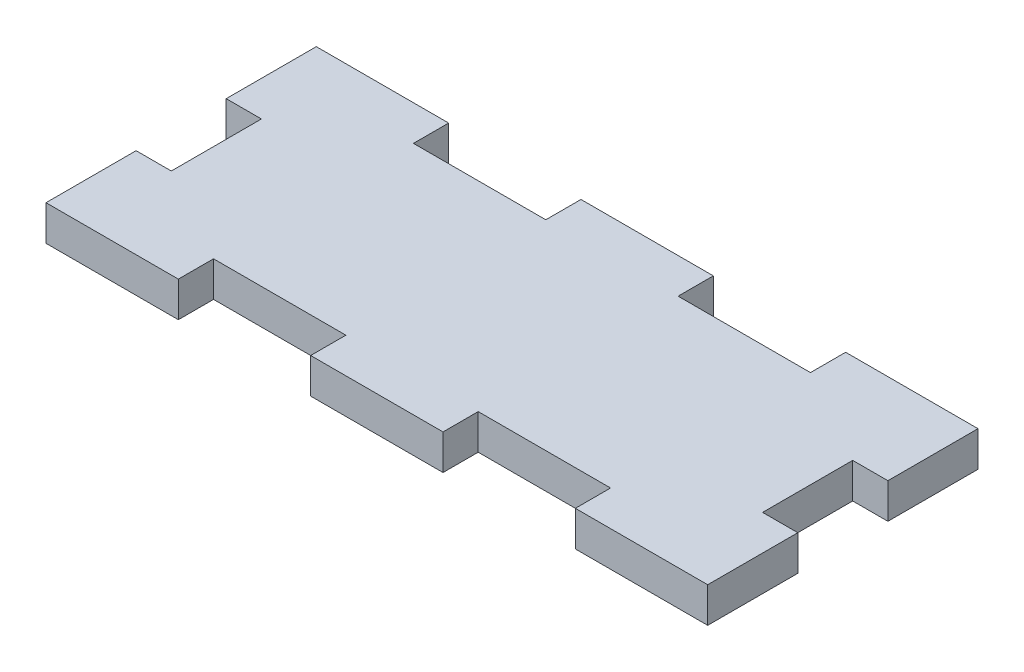
ISO-10303-21;
HEADER;
FILE_DESCRIPTION(('STEP AP214'),'2;1');
FILE_NAME('part.step','',(''),(''),'','','');
FILE_SCHEMA(('AUTOMOTIVE_DESIGN { 1 0 10303 214 1 1 1 1 }'));
ENDSEC;
DATA;
#1=APPLICATION_CONTEXT('core data for automotive mechanical design processes');
#2=APPLICATION_PROTOCOL_DEFINITION('international standard','automotive_design',2000,#1);
#3=PRODUCT_CONTEXT('',#1,'mechanical');
#4=PRODUCT('Part','Part','',(#3));
#5=PRODUCT_RELATED_PRODUCT_CATEGORY('part','',(#4));
#6=PRODUCT_DEFINITION_FORMATION('','',#4);
#7=PRODUCT_DEFINITION_CONTEXT('part definition',#1,'design');
#8=PRODUCT_DEFINITION('design','',#6,#7);
#9=PRODUCT_DEFINITION_SHAPE('','',#8);
#10=(LENGTH_UNIT() NAMED_UNIT(*) SI_UNIT(.MILLI.,.METRE.));
#11=(NAMED_UNIT(*) PLANE_ANGLE_UNIT() SI_UNIT($,.RADIAN.));
#12=(NAMED_UNIT(*) SI_UNIT($,.STERADIAN.) SOLID_ANGLE_UNIT());
#13=UNCERTAINTY_MEASURE_WITH_UNIT(LENGTH_MEASURE(1.E-05),#10,'distance_accuracy_value','');
#14=(GEOMETRIC_REPRESENTATION_CONTEXT(3) GLOBAL_UNCERTAINTY_ASSIGNED_CONTEXT((#13)) GLOBAL_UNIT_ASSIGNED_CONTEXT((#10,
#11,#12)) REPRESENTATION_CONTEXT('',''));
#15=CARTESIAN_POINT('',(0.,0.,0.));
#16=DIRECTION('',(0.,0.,1.));
#17=DIRECTION('',(1.,0.,0.));
#18=AXIS2_PLACEMENT_3D('',#15,#16,#17);
#19=CARTESIAN_POINT('',(29.845,3.175,12.192));
#20=DIRECTION('',(-1.,0.,0.));
#21=DIRECTION('',(0.,0.,1.));
#22=AXIS2_PLACEMENT_3D('',#19,#20,#21);
#23=PLANE('',#22);
#24=DIRECTION('',(0.,0.,-1.));
#25=VECTOR('',#24,1.);
#26=CARTESIAN_POINT('',(29.845,0.,12.192));
#27=LINE('',#26,#25);
#28=CARTESIAN_POINT('',(29.845,0.,12.192));
#29=VERTEX_POINT('',#28);
#30=CARTESIAN_POINT('',(29.845,0.,4.064));
#31=VERTEX_POINT('',#30);
#32=EDGE_CURVE('E396',#29,#31,#27,.T.);
#33=ORIENTED_EDGE('',*,*,#32,.T.);
#34=DIRECTION('',(0.,1.,0.));
#35=VECTOR('',#34,1.);
#36=CARTESIAN_POINT('',(29.845,3.175,4.064));
#37=LINE('',#36,#35);
#38=CARTESIAN_POINT('',(29.845,3.175,4.064));
#39=VERTEX_POINT('',#38);
#40=EDGE_CURVE('E264',#31,#39,#37,.T.);
#41=ORIENTED_EDGE('',*,*,#40,.T.);
#42=DIRECTION('',(0.,0.,-1.));
#43=VECTOR('',#42,1.);
#44=CARTESIAN_POINT('',(29.845,3.175,12.192));
#45=LINE('',#44,#43);
#46=CARTESIAN_POINT('',(29.845,3.175,12.192));
#47=VERTEX_POINT('',#46);
#48=EDGE_CURVE('E377',#47,#39,#45,.T.);
#49=ORIENTED_EDGE('',*,*,#48,.F.);
#50=DIRECTION('',(0.,-1.,0.));
#51=VECTOR('',#50,1.);
#52=CARTESIAN_POINT('',(29.845,3.175,12.192));
#53=LINE('',#52,#51);
#54=EDGE_CURVE('E394',#47,#29,#53,.T.);
#55=ORIENTED_EDGE('',*,*,#54,.T.);
#56=EDGE_LOOP('',(#33,#41,#49,#55));
#57=FACE_BOUND('',#56,.T.);
#58=ADVANCED_FACE('F33',(#57),#23,.F.);
#59=CARTESIAN_POINT('',(-29.845,3.175,12.192));
#60=DIRECTION('',(1.,0.,0.));
#61=DIRECTION('',(0.,0.,-1.));
#62=AXIS2_PLACEMENT_3D('',#59,#60,#61);
#63=PLANE('',#62);
#64=DIRECTION('',(0.,0.,1.));
#65=VECTOR('',#64,1.);
#66=CARTESIAN_POINT('',(-29.845,3.175,12.192));
#67=LINE('',#66,#65);
#68=CARTESIAN_POINT('',(-29.845,3.175,4.064));
#69=VERTEX_POINT('',#68);
#70=CARTESIAN_POINT('',(-29.845,3.175,12.192));
#71=VERTEX_POINT('',#70);
#72=EDGE_CURVE('E385',#69,#71,#67,.T.);
#73=ORIENTED_EDGE('',*,*,#72,.F.);
#74=DIRECTION('',(0.,-1.,0.));
#75=VECTOR('',#74,1.);
#76=CARTESIAN_POINT('',(-29.845,3.175,4.064));
#77=LINE('',#76,#75);
#78=CARTESIAN_POINT('',(-29.845,0.,4.064));
#79=VERTEX_POINT('',#78);
#80=EDGE_CURVE('E268',#69,#79,#77,.T.);
#81=ORIENTED_EDGE('',*,*,#80,.T.);
#82=DIRECTION('',(0.,0.,1.));
#83=VECTOR('',#82,1.);
#84=CARTESIAN_POINT('',(-29.845,0.,12.192));
#85=LINE('',#84,#83);
#86=CARTESIAN_POINT('',(-29.845,0.,12.192));
#87=VERTEX_POINT('',#86);
#88=EDGE_CURVE('E403',#79,#87,#85,.T.);
#89=ORIENTED_EDGE('',*,*,#88,.T.);
#90=DIRECTION('',(0.,-1.,0.));
#91=VECTOR('',#90,1.);
#92=CARTESIAN_POINT('',(-29.845,3.175,12.192));
#93=LINE('',#92,#91);
#94=EDGE_CURVE('E414',#71,#87,#93,.T.);
#95=ORIENTED_EDGE('',*,*,#94,.F.);
#96=EDGE_LOOP('',(#73,#81,#89,#95));
#97=FACE_BOUND('',#96,.T.);
#98=ADVANCED_FACE('F483',(#97),#63,.F.);
#99=CARTESIAN_POINT('',(-29.845,3.175,-12.192));
#100=DIRECTION('',(0.,0.,1.));
#101=DIRECTION('',(1.,0.,0.));
#102=AXIS2_PLACEMENT_3D('',#99,#100,#101);
#103=PLANE('',#102);
#104=DIRECTION('',(-1.,0.,0.));
#105=VECTOR('',#104,1.);
#106=CARTESIAN_POINT('',(-29.845,3.175,-12.192));
#107=LINE('',#106,#105);
#108=CARTESIAN_POINT('',(-17.907,3.175,-12.192));
#109=VERTEX_POINT('',#108);
#110=CARTESIAN_POINT('',(-29.845,3.175,-12.192));
#111=VERTEX_POINT('',#110);
#112=EDGE_CURVE('E380',#109,#111,#107,.T.);
#113=ORIENTED_EDGE('',*,*,#112,.F.);
#114=DIRECTION('',(0.,1.,0.));
#115=VECTOR('',#114,1.);
#116=CARTESIAN_POINT('',(-17.907,0.,-12.192));
#117=LINE('',#116,#115);
#118=CARTESIAN_POINT('',(-17.907,0.,-12.192));
#119=VERTEX_POINT('',#118);
#120=EDGE_CURVE('E291',#119,#109,#117,.T.);
#121=ORIENTED_EDGE('',*,*,#120,.F.);
#122=DIRECTION('',(-1.,0.,0.));
#123=VECTOR('',#122,1.);
#124=CARTESIAN_POINT('',(-29.845,0.,-12.192));
#125=LINE('',#124,#123);
#126=CARTESIAN_POINT('',(-29.845,0.,-12.192));
#127=VERTEX_POINT('',#126);
#128=EDGE_CURVE('E399',#119,#127,#125,.T.);
#129=ORIENTED_EDGE('',*,*,#128,.T.);
#130=DIRECTION('',(0.,-1.,0.));
#131=VECTOR('',#130,1.);
#132=CARTESIAN_POINT('',(-29.845,3.175,-12.192));
#133=LINE('',#132,#131);
#134=EDGE_CURVE('E417',#111,#127,#133,.T.);
#135=ORIENTED_EDGE('',*,*,#134,.F.);
#136=EDGE_LOOP('',(#113,#121,#129,#135));
#137=FACE_BOUND('',#136,.T.);
#138=ADVANCED_FACE('F487',(#137),#103,.F.);
#139=CARTESIAN_POINT('',(-29.845,3.175,12.192));
#140=DIRECTION('',(0.,0.,-1.));
#141=DIRECTION('',(-1.,0.,0.));
#142=AXIS2_PLACEMENT_3D('',#139,#140,#141);
#143=PLANE('',#142);
#144=DIRECTION('',(1.,0.,0.));
#145=VECTOR('',#144,1.);
#146=CARTESIAN_POINT('',(-29.845,0.,12.192));
#147=LINE('',#146,#145);
#148=CARTESIAN_POINT('',(-17.907,0.,12.192));
#149=VERTEX_POINT('',#148);
#150=EDGE_CURVE('E408',#87,#149,#147,.T.);
#151=ORIENTED_EDGE('',*,*,#150,.T.);
#152=DIRECTION('',(0.,1.,0.));
#153=VECTOR('',#152,1.);
#154=CARTESIAN_POINT('',(-17.907,0.,12.192));
#155=LINE('',#154,#153);
#156=CARTESIAN_POINT('',(-17.907,3.175,12.192));
#157=VERTEX_POINT('',#156);
#158=EDGE_CURVE('E310',#149,#157,#155,.T.);
#159=ORIENTED_EDGE('',*,*,#158,.T.);
#160=DIRECTION('',(1.,0.,0.));
#161=VECTOR('',#160,1.);
#162=CARTESIAN_POINT('',(-29.845,3.175,12.192));
#163=LINE('',#162,#161);
#164=EDGE_CURVE('E391',#71,#157,#163,.T.);
#165=ORIENTED_EDGE('',*,*,#164,.F.);
#166=ORIENTED_EDGE('',*,*,#94,.T.);
#167=EDGE_LOOP('',(#151,#159,#165,#166));
#168=FACE_BOUND('',#167,.T.);
#169=ADVANCED_FACE('F475',(#168),#143,.F.);
#170=CARTESIAN_POINT('',(5.969,0.,-12.192));
#171=VERTEX_POINT('',#170);
#172=CARTESIAN_POINT('',(-5.969,0.,-12.192));
#173=VERTEX_POINT('',#172);
#174=EDGE_CURVE('E404',#171,#173,#125,.T.);
#175=ORIENTED_EDGE('',*,*,#174,.T.);
#176=DIRECTION('',(0.,1.,0.));
#177=VECTOR('',#176,1.);
#178=CARTESIAN_POINT('',(-5.969,0.,-12.192));
#179=LINE('',#178,#177);
#180=CARTESIAN_POINT('',(-5.969,3.175,-12.192));
#181=VERTEX_POINT('',#180);
#182=EDGE_CURVE('E294',#173,#181,#179,.T.);
#183=ORIENTED_EDGE('',*,*,#182,.T.);
#184=CARTESIAN_POINT('',(5.969,3.175,-12.192));
#185=VERTEX_POINT('',#184);
#186=EDGE_CURVE('E386',#185,#181,#107,.T.);
#187=ORIENTED_EDGE('',*,*,#186,.F.);
#188=DIRECTION('',(0.,1.,0.));
#189=VECTOR('',#188,1.);
#190=CARTESIAN_POINT('',(5.969,0.,-12.192));
#191=LINE('',#190,#189);
#192=EDGE_CURVE('E343',#171,#185,#191,.T.);
#193=ORIENTED_EDGE('',*,*,#192,.F.);
#194=EDGE_LOOP('',(#175,#183,#187,#193));
#195=FACE_BOUND('',#194,.T.);
#196=ADVANCED_FACE('F486',(#195),#103,.F.);
#197=CARTESIAN_POINT('',(-5.969,3.175,12.192));
#198=VERTEX_POINT('',#197);
#199=CARTESIAN_POINT('',(5.96899999999999,3.175,12.192));
#200=VERTEX_POINT('',#199);
#201=EDGE_CURVE('E395',#198,#200,#163,.T.);
#202=ORIENTED_EDGE('',*,*,#201,.F.);
#203=DIRECTION('',(0.,1.,0.));
#204=VECTOR('',#203,1.);
#205=CARTESIAN_POINT('',(-5.969,0.,12.192));
#206=LINE('',#205,#204);
#207=CARTESIAN_POINT('',(-5.969,0.,12.192));
#208=VERTEX_POINT('',#207);
#209=EDGE_CURVE('E320',#208,#198,#206,.T.);
#210=ORIENTED_EDGE('',*,*,#209,.F.);
#211=CARTESIAN_POINT('',(5.96899999999999,0.,12.192));
#212=VERTEX_POINT('',#211);
#213=EDGE_CURVE('E411',#208,#212,#147,.T.);
#214=ORIENTED_EDGE('',*,*,#213,.T.);
#215=DIRECTION('',(0.,1.,0.));
#216=VECTOR('',#215,1.);
#217=CARTESIAN_POINT('',(5.96899999999999,0.,12.192));
#218=LINE('',#217,#216);
#219=EDGE_CURVE('E362',#212,#200,#218,.T.);
#220=ORIENTED_EDGE('',*,*,#219,.T.);
#221=EDGE_LOOP('',(#202,#210,#214,#220));
#222=FACE_BOUND('',#221,.T.);
#223=ADVANCED_FACE('F456',(#222),#143,.F.);
#224=CARTESIAN_POINT('',(29.845,3.175,-4.064));
#225=VERTEX_POINT('',#224);
#226=CARTESIAN_POINT('',(29.845,3.175,-12.192));
#227=VERTEX_POINT('',#226);
#228=EDGE_CURVE('E381',#225,#227,#45,.T.);
#229=ORIENTED_EDGE('',*,*,#228,.F.);
#230=DIRECTION('',(0.,-1.,0.));
#231=VECTOR('',#230,1.);
#232=CARTESIAN_POINT('',(29.845,3.175,-4.064));
#233=LINE('',#232,#231);
#234=CARTESIAN_POINT('',(29.845,0.,-4.064));
#235=VERTEX_POINT('',#234);
#236=EDGE_CURVE('E246',#225,#235,#233,.T.);
#237=ORIENTED_EDGE('',*,*,#236,.T.);
#238=CARTESIAN_POINT('',(29.845,0.,-12.192));
#239=VERTEX_POINT('',#238);
#240=EDGE_CURVE('E345',#235,#239,#27,.T.);
#241=ORIENTED_EDGE('',*,*,#240,.T.);
#242=DIRECTION('',(0.,-1.,0.));
#243=VECTOR('',#242,1.);
#244=CARTESIAN_POINT('',(29.845,3.175,-12.192));
#245=LINE('',#244,#243);
#246=EDGE_CURVE('E420',#227,#239,#245,.T.);
#247=ORIENTED_EDGE('',*,*,#246,.F.);
#248=EDGE_LOOP('',(#229,#237,#241,#247));
#249=FACE_BOUND('',#248,.T.);
#250=ADVANCED_FACE('F35',(#249),#23,.F.);
#251=CARTESIAN_POINT('',(17.907,0.,-12.192));
#252=VERTEX_POINT('',#251);
#253=EDGE_CURVE('E400',#239,#252,#125,.T.);
#254=ORIENTED_EDGE('',*,*,#253,.T.);
#255=DIRECTION('',(0.,1.,0.));
#256=VECTOR('',#255,1.);
#257=CARTESIAN_POINT('',(17.907,0.,-12.192));
#258=LINE('',#257,#256);
#259=CARTESIAN_POINT('',(17.907,3.175,-12.192));
#260=VERTEX_POINT('',#259);
#261=EDGE_CURVE('E346',#252,#260,#258,.T.);
#262=ORIENTED_EDGE('',*,*,#261,.T.);
#263=EDGE_CURVE('E382',#227,#260,#107,.T.);
#264=ORIENTED_EDGE('',*,*,#263,.F.);
#265=ORIENTED_EDGE('',*,*,#246,.T.);
#266=EDGE_LOOP('',(#254,#262,#264,#265));
#267=FACE_BOUND('',#266,.T.);
#268=ADVANCED_FACE('F433',(#267),#103,.F.);
#269=CARTESIAN_POINT('',(-29.845,0.,-4.06399999999999));
#270=VERTEX_POINT('',#269);
#271=EDGE_CURVE('E405',#127,#270,#85,.T.);
#272=ORIENTED_EDGE('',*,*,#271,.T.);
#273=DIRECTION('',(0.,1.,0.));
#274=VECTOR('',#273,1.);
#275=CARTESIAN_POINT('',(-29.845,3.175,-4.064));
#276=LINE('',#275,#274);
#277=CARTESIAN_POINT('',(-29.845,3.175,-4.064));
#278=VERTEX_POINT('',#277);
#279=EDGE_CURVE('E56',#270,#278,#276,.T.);
#280=ORIENTED_EDGE('',*,*,#279,.T.);
#281=EDGE_CURVE('E387',#111,#278,#67,.T.);
#282=ORIENTED_EDGE('',*,*,#281,.F.);
#283=ORIENTED_EDGE('',*,*,#134,.T.);
#284=EDGE_LOOP('',(#272,#280,#282,#283));
#285=FACE_BOUND('',#284,.T.);
#286=ADVANCED_FACE('F473',(#285),#63,.F.);
#287=CARTESIAN_POINT('',(17.907,3.175,12.192));
#288=VERTEX_POINT('',#287);
#289=EDGE_CURVE('E390',#288,#47,#163,.T.);
#290=ORIENTED_EDGE('',*,*,#289,.F.);
#291=DIRECTION('',(0.,1.,0.));
#292=VECTOR('',#291,1.);
#293=CARTESIAN_POINT('',(17.907,0.,12.192));
#294=LINE('',#293,#292);
#295=CARTESIAN_POINT('',(17.907,0.,12.192));
#296=VERTEX_POINT('',#295);
#297=EDGE_CURVE('E373',#296,#288,#294,.T.);
#298=ORIENTED_EDGE('',*,*,#297,.F.);
#299=EDGE_CURVE('E407',#296,#29,#147,.T.);
#300=ORIENTED_EDGE('',*,*,#299,.T.);
#301=ORIENTED_EDGE('',*,*,#54,.F.);
#302=EDGE_LOOP('',(#290,#298,#300,#301));
#303=FACE_BOUND('',#302,.T.);
#304=ADVANCED_FACE('F471',(#303),#143,.F.);
#305=CARTESIAN_POINT('',(0.,3.175,0.));
#306=DIRECTION('',(0.,-1.,0.));
#307=DIRECTION('',(0.,0.,-1.));
#308=AXIS2_PLACEMENT_3D('',#305,#306,#307);
#309=PLANE('',#308);
#310=DIRECTION('',(0.,0.,-1.));
#311=VECTOR('',#310,1.);
#312=CARTESIAN_POINT('',(-26.67,3.175,4.064));
#313=LINE('',#312,#311);
#314=CARTESIAN_POINT('',(-26.67,3.175,4.064));
#315=VERTEX_POINT('',#314);
#316=CARTESIAN_POINT('',(-26.67,3.175,-4.064));
#317=VERTEX_POINT('',#316);
#318=EDGE_CURVE('E226',#315,#317,#313,.T.);
#319=ORIENTED_EDGE('',*,*,#318,.F.);
#320=DIRECTION('',(1.,0.,0.));
#321=VECTOR('',#320,1.);
#322=CARTESIAN_POINT('',(-33.02,3.175,4.064));
#323=LINE('',#322,#321);
#324=EDGE_CURVE('E238',#69,#315,#323,.T.);
#325=ORIENTED_EDGE('',*,*,#324,.F.);
#326=ORIENTED_EDGE('',*,*,#72,.T.);
#327=ORIENTED_EDGE('',*,*,#164,.T.);
#328=DIRECTION('',(0.,0.,1.));
#329=VECTOR('',#328,1.);
#330=CARTESIAN_POINT('',(-17.907,3.175,12.192));
#331=LINE('',#330,#329);
#332=CARTESIAN_POINT('',(-17.907,3.175,9.017));
#333=VERTEX_POINT('',#332);
#334=EDGE_CURVE('E271',#333,#157,#331,.T.);
#335=ORIENTED_EDGE('',*,*,#334,.F.);
#336=DIRECTION('',(-1.,0.,0.));
#337=VECTOR('',#336,1.);
#338=CARTESIAN_POINT('',(-17.907,3.175,9.017));
#339=LINE('',#338,#337);
#340=CARTESIAN_POINT('',(-5.969,3.175,9.017));
#341=VERTEX_POINT('',#340);
#342=EDGE_CURVE('E304',#341,#333,#339,.T.);
#343=ORIENTED_EDGE('',*,*,#342,.F.);
#344=DIRECTION('',(0.,0.,-1.));
#345=VECTOR('',#344,1.);
#346=CARTESIAN_POINT('',(-5.969,3.175,12.192));
#347=LINE('',#346,#345);
#348=EDGE_CURVE('E312',#198,#341,#347,.T.);
#349=ORIENTED_EDGE('',*,*,#348,.F.);
#350=ORIENTED_EDGE('',*,*,#201,.T.);
#351=DIRECTION('',(0.,0.,1.));
#352=VECTOR('',#351,1.);
#353=CARTESIAN_POINT('',(5.96899999999999,3.175,12.192));
#354=LINE('',#353,#352);
#355=CARTESIAN_POINT('',(5.96899999999999,3.175,9.017));
#356=VERTEX_POINT('',#355);
#357=EDGE_CURVE('E293',#356,#200,#354,.T.);
#358=ORIENTED_EDGE('',*,*,#357,.F.);
#359=DIRECTION('',(-1.,0.,0.));
#360=VECTOR('',#359,1.);
#361=CARTESIAN_POINT('',(5.96899999999999,3.175,9.017));
#362=LINE('',#361,#360);
#363=CARTESIAN_POINT('',(17.907,3.175,9.017));
#364=VERTEX_POINT('',#363);
#365=EDGE_CURVE('E356',#364,#356,#362,.T.);
#366=ORIENTED_EDGE('',*,*,#365,.F.);
#367=DIRECTION('',(0.,0.,-1.));
#368=VECTOR('',#367,1.);
#369=CARTESIAN_POINT('',(17.907,3.175,12.192));
#370=LINE('',#369,#368);
#371=EDGE_CURVE('E365',#288,#364,#370,.T.);
#372=ORIENTED_EDGE('',*,*,#371,.F.);
#373=ORIENTED_EDGE('',*,*,#289,.T.);
#374=ORIENTED_EDGE('',*,*,#48,.T.);
#375=DIRECTION('',(1.,0.,0.));
#376=VECTOR('',#375,1.);
#377=CARTESIAN_POINT('',(26.67,3.175,4.064));
#378=LINE('',#377,#376);
#379=CARTESIAN_POINT('',(26.67,3.175,4.064));
#380=VERTEX_POINT('',#379);
#381=EDGE_CURVE('E250',#380,#39,#378,.T.);
#382=ORIENTED_EDGE('',*,*,#381,.F.);
#383=DIRECTION('',(0.,0.,1.));
#384=VECTOR('',#383,1.);
#385=CARTESIAN_POINT('',(26.67,3.175,4.064));
#386=LINE('',#385,#384);
#387=CARTESIAN_POINT('',(26.67,3.175,-4.064));
#388=VERTEX_POINT('',#387);
#389=EDGE_CURVE('E256',#388,#380,#386,.T.);
#390=ORIENTED_EDGE('',*,*,#389,.F.);
#391=DIRECTION('',(-1.,0.,0.));
#392=VECTOR('',#391,1.);
#393=CARTESIAN_POINT('',(26.67,3.175,-4.064));
#394=LINE('',#393,#392);
#395=EDGE_CURVE('E254',#225,#388,#394,.T.);
#396=ORIENTED_EDGE('',*,*,#395,.F.);
#397=ORIENTED_EDGE('',*,*,#228,.T.);
#398=ORIENTED_EDGE('',*,*,#263,.T.);
#399=DIRECTION('',(0.,0.,-1.));
#400=VECTOR('',#399,1.);
#401=CARTESIAN_POINT('',(17.907,3.175,-9.01700000000001));
#402=LINE('',#401,#400);
#403=CARTESIAN_POINT('',(17.907,3.175,-9.01700000000001));
#404=VERTEX_POINT('',#403);
#405=EDGE_CURVE('E328',#404,#260,#402,.T.);
#406=ORIENTED_EDGE('',*,*,#405,.F.);
#407=DIRECTION('',(1.,0.,0.));
#408=VECTOR('',#407,1.);
#409=CARTESIAN_POINT('',(5.969,3.175,-9.01700000000001));
#410=LINE('',#409,#408);
#411=CARTESIAN_POINT('',(5.969,3.175,-9.01700000000001));
#412=VERTEX_POINT('',#411);
#413=EDGE_CURVE('E338',#412,#404,#410,.T.);
#414=ORIENTED_EDGE('',*,*,#413,.F.);
#415=DIRECTION('',(0.,0.,1.));
#416=VECTOR('',#415,1.);
#417=CARTESIAN_POINT('',(5.969,3.175,-9.01700000000001));
#418=LINE('',#417,#416);
#419=EDGE_CURVE('E335',#185,#412,#418,.T.);
#420=ORIENTED_EDGE('',*,*,#419,.F.);
#421=ORIENTED_EDGE('',*,*,#186,.T.);
#422=DIRECTION('',(0.,0.,-1.));
#423=VECTOR('',#422,1.);
#424=CARTESIAN_POINT('',(-5.969,3.175,-9.01700000000001));
#425=LINE('',#424,#423);
#426=CARTESIAN_POINT('',(-5.969,3.175,-9.01700000000001));
#427=VERTEX_POINT('',#426);
#428=EDGE_CURVE('E276',#427,#181,#425,.T.);
#429=ORIENTED_EDGE('',*,*,#428,.F.);
#430=DIRECTION('',(1.,0.,0.));
#431=VECTOR('',#430,1.);
#432=CARTESIAN_POINT('',(-17.907,3.175,-9.01700000000001));
#433=LINE('',#432,#431);
#434=CARTESIAN_POINT('',(-17.907,3.175,-9.01700000000001));
#435=VERTEX_POINT('',#434);
#436=EDGE_CURVE('E286',#435,#427,#433,.T.);
#437=ORIENTED_EDGE('',*,*,#436,.F.);
#438=DIRECTION('',(0.,0.,1.));
#439=VECTOR('',#438,1.);
#440=CARTESIAN_POINT('',(-17.907,3.175,-9.01700000000001));
#441=LINE('',#440,#439);
#442=EDGE_CURVE('E283',#109,#435,#441,.T.);
#443=ORIENTED_EDGE('',*,*,#442,.F.);
#444=ORIENTED_EDGE('',*,*,#112,.T.);
#445=ORIENTED_EDGE('',*,*,#281,.T.);
#446=DIRECTION('',(-1.,0.,0.));
#447=VECTOR('',#446,1.);
#448=CARTESIAN_POINT('',(-33.02,3.175,-4.064));
#449=LINE('',#448,#447);
#450=EDGE_CURVE('E240',#317,#278,#449,.T.);
#451=ORIENTED_EDGE('',*,*,#450,.F.);
#452=EDGE_LOOP('',(#319,#325,#326,#327,#335,#343,#349,#350,#358,#366,#372,#373,#374,#382,#390,
#396,#397,#398,#406,#414,#420,#421,#429,#437,#443,#444,#445,#451));
#453=FACE_BOUND('',#452,.T.);
#454=ADVANCED_FACE('F436',(#453),#309,.F.);
#455=CARTESIAN_POINT('',(0.,0.,0.));
#456=DIRECTION('',(0.,-1.,0.));
#457=DIRECTION('',(0.,0.,-1.));
#458=AXIS2_PLACEMENT_3D('',#455,#456,#457);
#459=PLANE('',#458);
#460=DIRECTION('',(-1.,0.,0.));
#461=VECTOR('',#460,1.);
#462=CARTESIAN_POINT('',(0.,0.,4.064));
#463=LINE('',#462,#461);
#464=CARTESIAN_POINT('',(-26.67,0.,4.064));
#465=VERTEX_POINT('',#464);
#466=EDGE_CURVE('E11',#465,#79,#463,.T.);
#467=ORIENTED_EDGE('',*,*,#466,.F.);
#468=DIRECTION('',(0.,0.,-1.));
#469=VECTOR('',#468,1.);
#470=CARTESIAN_POINT('',(-26.67,0.,4.064));
#471=LINE('',#470,#469);
#472=CARTESIAN_POINT('',(-26.67,0.,-4.064));
#473=VERTEX_POINT('',#472);
#474=EDGE_CURVE('E223',#465,#473,#471,.T.);
#475=ORIENTED_EDGE('',*,*,#474,.T.);
#476=DIRECTION('',(-1.,0.,0.));
#477=VECTOR('',#476,1.);
#478=CARTESIAN_POINT('',(-33.02,0.,-4.064));
#479=LINE('',#478,#477);
#480=EDGE_CURVE('E229',#473,#270,#479,.T.);
#481=ORIENTED_EDGE('',*,*,#480,.T.);
#482=ORIENTED_EDGE('',*,*,#271,.F.);
#483=ORIENTED_EDGE('',*,*,#128,.F.);
#484=DIRECTION('',(0.,0.,1.));
#485=VECTOR('',#484,1.);
#486=CARTESIAN_POINT('',(-17.907,0.,-9.01700000000001));
#487=LINE('',#486,#485);
#488=CARTESIAN_POINT('',(-17.907,0.,-9.01700000000001));
#489=VERTEX_POINT('',#488);
#490=EDGE_CURVE('E272',#119,#489,#487,.T.);
#491=ORIENTED_EDGE('',*,*,#490,.T.);
#492=DIRECTION('',(1.,0.,0.));
#493=VECTOR('',#492,1.);
#494=CARTESIAN_POINT('',(-17.907,0.,-9.01700000000001));
#495=LINE('',#494,#493);
#496=CARTESIAN_POINT('',(-5.969,0.,-9.01700000000001));
#497=VERTEX_POINT('',#496);
#498=EDGE_CURVE('E275',#489,#497,#495,.T.);
#499=ORIENTED_EDGE('',*,*,#498,.T.);
#500=DIRECTION('',(0.,0.,-1.));
#501=VECTOR('',#500,1.);
#502=CARTESIAN_POINT('',(-5.969,0.,-9.01700000000001));
#503=LINE('',#502,#501);
#504=EDGE_CURVE('E279',#497,#173,#503,.T.);
#505=ORIENTED_EDGE('',*,*,#504,.T.);
#506=ORIENTED_EDGE('',*,*,#174,.F.);
#507=DIRECTION('',(0.,0.,1.));
#508=VECTOR('',#507,1.);
#509=CARTESIAN_POINT('',(5.969,0.,-9.01700000000001));
#510=LINE('',#509,#508);
#511=CARTESIAN_POINT('',(5.969,0.,-9.01700000000001));
#512=VERTEX_POINT('',#511);
#513=EDGE_CURVE('E324',#171,#512,#510,.T.);
#514=ORIENTED_EDGE('',*,*,#513,.T.);
#515=DIRECTION('',(1.,0.,0.));
#516=VECTOR('',#515,1.);
#517=CARTESIAN_POINT('',(5.969,0.,-9.01700000000001));
#518=LINE('',#517,#516);
#519=CARTESIAN_POINT('',(17.907,0.,-9.01700000000001));
#520=VERTEX_POINT('',#519);
#521=EDGE_CURVE('E327',#512,#520,#518,.T.);
#522=ORIENTED_EDGE('',*,*,#521,.T.);
#523=DIRECTION('',(0.,0.,-1.));
#524=VECTOR('',#523,1.);
#525=CARTESIAN_POINT('',(17.907,0.,-9.01700000000001));
#526=LINE('',#525,#524);
#527=EDGE_CURVE('E331',#520,#252,#526,.T.);
#528=ORIENTED_EDGE('',*,*,#527,.T.);
#529=ORIENTED_EDGE('',*,*,#253,.F.);
#530=ORIENTED_EDGE('',*,*,#240,.F.);
#531=DIRECTION('',(1.,0.,0.));
#532=VECTOR('',#531,1.);
#533=CARTESIAN_POINT('',(0.,0.,-4.064));
#534=LINE('',#533,#532);
#535=CARTESIAN_POINT('',(26.67,0.,-4.064));
#536=VERTEX_POINT('',#535);
#537=EDGE_CURVE('E41',#536,#235,#534,.T.);
#538=ORIENTED_EDGE('',*,*,#537,.F.);
#539=DIRECTION('',(0.,0.,1.));
#540=VECTOR('',#539,1.);
#541=CARTESIAN_POINT('',(26.67,0.,4.064));
#542=LINE('',#541,#540);
#543=CARTESIAN_POINT('',(26.67,0.,4.064));
#544=VERTEX_POINT('',#543);
#545=EDGE_CURVE('E48',#536,#544,#542,.T.);
#546=ORIENTED_EDGE('',*,*,#545,.T.);
#547=DIRECTION('',(1.,0.,0.));
#548=VECTOR('',#547,1.);
#549=CARTESIAN_POINT('',(26.67,0.,4.064));
#550=LINE('',#549,#548);
#551=EDGE_CURVE('E249',#544,#31,#550,.T.);
#552=ORIENTED_EDGE('',*,*,#551,.T.);
#553=ORIENTED_EDGE('',*,*,#32,.F.);
#554=ORIENTED_EDGE('',*,*,#299,.F.);
#555=DIRECTION('',(0.,0.,-1.));
#556=VECTOR('',#555,1.);
#557=CARTESIAN_POINT('',(17.907,0.,12.192));
#558=LINE('',#557,#556);
#559=CARTESIAN_POINT('',(17.907,0.,9.017));
#560=VERTEX_POINT('',#559);
#561=EDGE_CURVE('E355',#296,#560,#558,.T.);
#562=ORIENTED_EDGE('',*,*,#561,.T.);
#563=DIRECTION('',(-1.,0.,0.));
#564=VECTOR('',#563,1.);
#565=CARTESIAN_POINT('',(5.96899999999999,0.,9.017));
#566=LINE('',#565,#564);
#567=CARTESIAN_POINT('',(5.96899999999999,0.,9.017));
#568=VERTEX_POINT('',#567);
#569=EDGE_CURVE('E359',#560,#568,#566,.T.);
#570=ORIENTED_EDGE('',*,*,#569,.T.);
#571=DIRECTION('',(0.,0.,1.));
#572=VECTOR('',#571,1.);
#573=CARTESIAN_POINT('',(5.96899999999999,0.,12.192));
#574=LINE('',#573,#572);
#575=EDGE_CURVE('E352',#568,#212,#574,.T.);
#576=ORIENTED_EDGE('',*,*,#575,.T.);
#577=ORIENTED_EDGE('',*,*,#213,.F.);
#578=DIRECTION('',(0.,0.,-1.));
#579=VECTOR('',#578,1.);
#580=CARTESIAN_POINT('',(-5.969,0.,12.192));
#581=LINE('',#580,#579);
#582=CARTESIAN_POINT('',(-5.969,0.,9.017));
#583=VERTEX_POINT('',#582);
#584=EDGE_CURVE('E303',#208,#583,#581,.T.);
#585=ORIENTED_EDGE('',*,*,#584,.T.);
#586=DIRECTION('',(-1.,0.,0.));
#587=VECTOR('',#586,1.);
#588=CARTESIAN_POINT('',(-17.907,0.,9.017));
#589=LINE('',#588,#587);
#590=CARTESIAN_POINT('',(-17.907,0.,9.017));
#591=VERTEX_POINT('',#590);
#592=EDGE_CURVE('E307',#583,#591,#589,.T.);
#593=ORIENTED_EDGE('',*,*,#592,.T.);
#594=DIRECTION('',(0.,0.,1.));
#595=VECTOR('',#594,1.);
#596=CARTESIAN_POINT('',(-17.907,0.,12.192));
#597=LINE('',#596,#595);
#598=EDGE_CURVE('E300',#591,#149,#597,.T.);
#599=ORIENTED_EDGE('',*,*,#598,.T.);
#600=ORIENTED_EDGE('',*,*,#150,.F.);
#601=ORIENTED_EDGE('',*,*,#88,.F.);
#602=EDGE_LOOP('',(#467,#475,#481,#482,#483,#491,#499,#505,#506,#514,#522,#528,#529,#530,#538,
#546,#552,#553,#554,#562,#570,#576,#577,#585,#593,#599,#600,#601));
#603=FACE_BOUND('',#602,.T.);
#604=ADVANCED_FACE('F236',(#603),#459,.T.);
#605=CARTESIAN_POINT('',(5.96899999999999,0.,12.192));
#606=DIRECTION('',(-1.,0.,0.));
#607=DIRECTION('',(0.,0.,1.));
#608=AXIS2_PLACEMENT_3D('',#605,#606,#607);
#609=PLANE('',#608);
#610=ORIENTED_EDGE('',*,*,#357,.T.);
#611=ORIENTED_EDGE('',*,*,#219,.F.);
#612=ORIENTED_EDGE('',*,*,#575,.F.);
#613=DIRECTION('',(0.,1.,0.));
#614=VECTOR('',#613,1.);
#615=CARTESIAN_POINT('',(5.96899999999999,0.,9.017));
#616=LINE('',#615,#614);
#617=EDGE_CURVE('E339',#568,#356,#616,.T.);
#618=ORIENTED_EDGE('',*,*,#617,.T.);
#619=EDGE_LOOP('',(#610,#611,#612,#618));
#620=FACE_BOUND('',#619,.T.);
#621=ADVANCED_FACE('F459',(#620),#609,.F.);
#622=CARTESIAN_POINT('',(5.96899999999999,0.,9.017));
#623=DIRECTION('',(0.,0.,-1.));
#624=DIRECTION('',(-1.,0.,0.));
#625=AXIS2_PLACEMENT_3D('',#622,#623,#624);
#626=PLANE('',#625);
#627=ORIENTED_EDGE('',*,*,#365,.T.);
#628=ORIENTED_EDGE('',*,*,#617,.F.);
#629=ORIENTED_EDGE('',*,*,#569,.F.);
#630=DIRECTION('',(0.,1.,0.));
#631=VECTOR('',#630,1.);
#632=CARTESIAN_POINT('',(17.907,0.,9.017));
#633=LINE('',#632,#631);
#634=EDGE_CURVE('E371',#560,#364,#633,.T.);
#635=ORIENTED_EDGE('',*,*,#634,.T.);
#636=EDGE_LOOP('',(#627,#628,#629,#635));
#637=FACE_BOUND('',#636,.T.);
#638=ADVANCED_FACE('F463',(#637),#626,.F.);
#639=CARTESIAN_POINT('',(17.907,0.,12.192));
#640=DIRECTION('',(1.,0.,0.));
#641=DIRECTION('',(0.,0.,-1.));
#642=AXIS2_PLACEMENT_3D('',#639,#640,#641);
#643=PLANE('',#642);
#644=ORIENTED_EDGE('',*,*,#371,.T.);
#645=ORIENTED_EDGE('',*,*,#634,.F.);
#646=ORIENTED_EDGE('',*,*,#561,.F.);
#647=ORIENTED_EDGE('',*,*,#297,.T.);
#648=EDGE_LOOP('',(#644,#645,#646,#647));
#649=FACE_BOUND('',#648,.T.);
#650=ADVANCED_FACE('F465',(#649),#643,.F.);
#651=CARTESIAN_POINT('',(5.969,0.,-9.01700000000001));
#652=DIRECTION('',(-1.,0.,0.));
#653=DIRECTION('',(0.,0.,1.));
#654=AXIS2_PLACEMENT_3D('',#651,#652,#653);
#655=PLANE('',#654);
#656=ORIENTED_EDGE('',*,*,#419,.T.);
#657=DIRECTION('',(0.,1.,0.));
#658=VECTOR('',#657,1.);
#659=CARTESIAN_POINT('',(5.969,0.,-9.01700000000001));
#660=LINE('',#659,#658);
#661=EDGE_CURVE('E334',#512,#412,#660,.T.);
#662=ORIENTED_EDGE('',*,*,#661,.F.);
#663=ORIENTED_EDGE('',*,*,#513,.F.);
#664=ORIENTED_EDGE('',*,*,#192,.T.);
#665=EDGE_LOOP('',(#656,#662,#663,#664));
#666=FACE_BOUND('',#665,.T.);
#667=ADVANCED_FACE('F522',(#666),#655,.F.);
#668=CARTESIAN_POINT('',(17.907,0.,-9.01700000000001));
#669=DIRECTION('',(1.,0.,0.));
#670=DIRECTION('',(0.,0.,-1.));
#671=AXIS2_PLACEMENT_3D('',#668,#669,#670);
#672=PLANE('',#671);
#673=ORIENTED_EDGE('',*,*,#405,.T.);
#674=ORIENTED_EDGE('',*,*,#261,.F.);
#675=ORIENTED_EDGE('',*,*,#527,.F.);
#676=DIRECTION('',(0.,1.,0.));
#677=VECTOR('',#676,1.);
#678=CARTESIAN_POINT('',(17.907,0.,-9.01700000000001));
#679=LINE('',#678,#677);
#680=EDGE_CURVE('E349',#520,#404,#679,.T.);
#681=ORIENTED_EDGE('',*,*,#680,.T.);
#682=EDGE_LOOP('',(#673,#674,#675,#681));
#683=FACE_BOUND('',#682,.T.);
#684=ADVANCED_FACE('F528',(#683),#672,.F.);
#685=CARTESIAN_POINT('',(5.969,0.,-9.01700000000001));
#686=DIRECTION('',(0.,0.,1.));
#687=DIRECTION('',(1.,0.,0.));
#688=AXIS2_PLACEMENT_3D('',#685,#686,#687);
#689=PLANE('',#688);
#690=ORIENTED_EDGE('',*,*,#413,.T.);
#691=ORIENTED_EDGE('',*,*,#680,.F.);
#692=ORIENTED_EDGE('',*,*,#521,.F.);
#693=ORIENTED_EDGE('',*,*,#661,.T.);
#694=EDGE_LOOP('',(#690,#691,#692,#693));
#695=FACE_BOUND('',#694,.T.);
#696=ADVANCED_FACE('F526',(#695),#689,.F.);
#697=CARTESIAN_POINT('',(-17.907,0.,12.192));
#698=DIRECTION('',(-1.,0.,0.));
#699=DIRECTION('',(0.,0.,1.));
#700=AXIS2_PLACEMENT_3D('',#697,#698,#699);
#701=PLANE('',#700);
#702=ORIENTED_EDGE('',*,*,#334,.T.);
#703=ORIENTED_EDGE('',*,*,#158,.F.);
#704=ORIENTED_EDGE('',*,*,#598,.F.);
#705=DIRECTION('',(0.,1.,0.));
#706=VECTOR('',#705,1.);
#707=CARTESIAN_POINT('',(-17.907,0.,9.017));
#708=LINE('',#707,#706);
#709=EDGE_CURVE('E287',#591,#333,#708,.T.);
#710=ORIENTED_EDGE('',*,*,#709,.T.);
#711=EDGE_LOOP('',(#702,#703,#704,#710));
#712=FACE_BOUND('',#711,.T.);
#713=ADVANCED_FACE('F535',(#712),#701,.F.);
#714=CARTESIAN_POINT('',(-17.907,0.,9.017));
#715=DIRECTION('',(0.,0.,-1.));
#716=DIRECTION('',(-1.,0.,0.));
#717=AXIS2_PLACEMENT_3D('',#714,#715,#716);
#718=PLANE('',#717);
#719=ORIENTED_EDGE('',*,*,#342,.T.);
#720=ORIENTED_EDGE('',*,*,#709,.F.);
#721=ORIENTED_EDGE('',*,*,#592,.F.);
#722=DIRECTION('',(0.,1.,0.));
#723=VECTOR('',#722,1.);
#724=CARTESIAN_POINT('',(-5.969,0.,9.017));
#725=LINE('',#724,#723);
#726=EDGE_CURVE('E318',#583,#341,#725,.T.);
#727=ORIENTED_EDGE('',*,*,#726,.T.);
#728=EDGE_LOOP('',(#719,#720,#721,#727));
#729=FACE_BOUND('',#728,.T.);
#730=ADVANCED_FACE('F609',(#729),#718,.F.);
#731=CARTESIAN_POINT('',(-5.969,0.,12.192));
#732=DIRECTION('',(1.,0.,0.));
#733=DIRECTION('',(0.,0.,-1.));
#734=AXIS2_PLACEMENT_3D('',#731,#732,#733);
#735=PLANE('',#734);
#736=ORIENTED_EDGE('',*,*,#348,.T.);
#737=ORIENTED_EDGE('',*,*,#726,.F.);
#738=ORIENTED_EDGE('',*,*,#584,.F.);
#739=ORIENTED_EDGE('',*,*,#209,.T.);
#740=EDGE_LOOP('',(#736,#737,#738,#739));
#741=FACE_BOUND('',#740,.T.);
#742=ADVANCED_FACE('F618',(#741),#735,.F.);
#743=CARTESIAN_POINT('',(-17.907,0.,-9.01700000000001));
#744=DIRECTION('',(-1.,0.,0.));
#745=DIRECTION('',(0.,0.,1.));
#746=AXIS2_PLACEMENT_3D('',#743,#744,#745);
#747=PLANE('',#746);
#748=ORIENTED_EDGE('',*,*,#442,.T.);
#749=DIRECTION('',(0.,1.,0.));
#750=VECTOR('',#749,1.);
#751=CARTESIAN_POINT('',(-17.907,0.,-9.01700000000001));
#752=LINE('',#751,#750);
#753=EDGE_CURVE('E282',#489,#435,#752,.T.);
#754=ORIENTED_EDGE('',*,*,#753,.F.);
#755=ORIENTED_EDGE('',*,*,#490,.F.);
#756=ORIENTED_EDGE('',*,*,#120,.T.);
#757=EDGE_LOOP('',(#748,#754,#755,#756));
#758=FACE_BOUND('',#757,.T.);
#759=ADVANCED_FACE('F628',(#758),#747,.F.);
#760=CARTESIAN_POINT('',(-5.969,0.,-9.01700000000001));
#761=DIRECTION('',(1.,0.,0.));
#762=DIRECTION('',(0.,0.,-1.));
#763=AXIS2_PLACEMENT_3D('',#760,#761,#762);
#764=PLANE('',#763);
#765=ORIENTED_EDGE('',*,*,#428,.T.);
#766=ORIENTED_EDGE('',*,*,#182,.F.);
#767=ORIENTED_EDGE('',*,*,#504,.F.);
#768=DIRECTION('',(0.,1.,0.));
#769=VECTOR('',#768,1.);
#770=CARTESIAN_POINT('',(-5.969,0.,-9.01700000000001));
#771=LINE('',#770,#769);
#772=EDGE_CURVE('E297',#497,#427,#771,.T.);
#773=ORIENTED_EDGE('',*,*,#772,.T.);
#774=EDGE_LOOP('',(#765,#766,#767,#773));
#775=FACE_BOUND('',#774,.T.);
#776=ADVANCED_FACE('F637',(#775),#764,.F.);
#777=CARTESIAN_POINT('',(-17.907,0.,-9.01700000000001));
#778=DIRECTION('',(0.,0.,1.));
#779=DIRECTION('',(1.,0.,0.));
#780=AXIS2_PLACEMENT_3D('',#777,#778,#779);
#781=PLANE('',#780);
#782=ORIENTED_EDGE('',*,*,#436,.T.);
#783=ORIENTED_EDGE('',*,*,#772,.F.);
#784=ORIENTED_EDGE('',*,*,#498,.F.);
#785=ORIENTED_EDGE('',*,*,#753,.T.);
#786=EDGE_LOOP('',(#782,#783,#784,#785));
#787=FACE_BOUND('',#786,.T.);
#788=ADVANCED_FACE('F647',(#787),#781,.F.);
#789=CARTESIAN_POINT('',(26.67,0.,4.064));
#790=DIRECTION('',(0.,0.,1.));
#791=DIRECTION('',(1.,0.,0.));
#792=AXIS2_PLACEMENT_3D('',#789,#790,#791);
#793=PLANE('',#792);
#794=ORIENTED_EDGE('',*,*,#551,.F.);
#795=DIRECTION('',(0.,1.,0.));
#796=VECTOR('',#795,1.);
#797=CARTESIAN_POINT('',(26.67,0.,4.064));
#798=LINE('',#797,#796);
#799=EDGE_CURVE('E244',#544,#380,#798,.T.);
#800=ORIENTED_EDGE('',*,*,#799,.T.);
#801=ORIENTED_EDGE('',*,*,#381,.T.);
#802=ORIENTED_EDGE('',*,*,#40,.F.);
#803=EDGE_LOOP('',(#794,#800,#801,#802));
#804=FACE_BOUND('',#803,.T.);
#805=ADVANCED_FACE('F444',(#804),#793,.F.);
#806=CARTESIAN_POINT('',(26.67,0.,-4.064));
#807=DIRECTION('',(0.,0.,-1.));
#808=DIRECTION('',(-1.,0.,0.));
#809=AXIS2_PLACEMENT_3D('',#806,#807,#808);
#810=PLANE('',#809);
#811=ORIENTED_EDGE('',*,*,#395,.T.);
#812=DIRECTION('',(0.,1.,0.));
#813=VECTOR('',#812,1.);
#814=CARTESIAN_POINT('',(26.67,0.,-4.064));
#815=LINE('',#814,#813);
#816=EDGE_CURVE('E253',#536,#388,#815,.T.);
#817=ORIENTED_EDGE('',*,*,#816,.F.);
#818=ORIENTED_EDGE('',*,*,#537,.T.);
#819=ORIENTED_EDGE('',*,*,#236,.F.);
#820=EDGE_LOOP('',(#811,#817,#818,#819));
#821=FACE_BOUND('',#820,.T.);
#822=ADVANCED_FACE('F424',(#821),#810,.F.);
#823=CARTESIAN_POINT('',(26.67,0.,4.064));
#824=DIRECTION('',(-1.,0.,0.));
#825=DIRECTION('',(0.,0.,1.));
#826=AXIS2_PLACEMENT_3D('',#823,#824,#825);
#827=PLANE('',#826);
#828=ORIENTED_EDGE('',*,*,#389,.T.);
#829=ORIENTED_EDGE('',*,*,#799,.F.);
#830=ORIENTED_EDGE('',*,*,#545,.F.);
#831=ORIENTED_EDGE('',*,*,#816,.T.);
#832=EDGE_LOOP('',(#828,#829,#830,#831));
#833=FACE_BOUND('',#832,.T.);
#834=ADVANCED_FACE('F440',(#833),#827,.F.);
#835=CARTESIAN_POINT('',(-33.02,0.,4.064));
#836=DIRECTION('',(0.,0.,1.));
#837=DIRECTION('',(1.,0.,0.));
#838=AXIS2_PLACEMENT_3D('',#835,#836,#837);
#839=PLANE('',#838);
#840=ORIENTED_EDGE('',*,*,#324,.T.);
#841=DIRECTION('',(0.,1.,0.));
#842=VECTOR('',#841,1.);
#843=CARTESIAN_POINT('',(-26.67,0.,4.064));
#844=LINE('',#843,#842);
#845=EDGE_CURVE('E228',#465,#315,#844,.T.);
#846=ORIENTED_EDGE('',*,*,#845,.F.);
#847=ORIENTED_EDGE('',*,*,#466,.T.);
#848=ORIENTED_EDGE('',*,*,#80,.F.);
#849=EDGE_LOOP('',(#840,#846,#847,#848));
#850=FACE_BOUND('',#849,.T.);
#851=ADVANCED_FACE('F714',(#850),#839,.F.);
#852=CARTESIAN_POINT('',(-33.02,0.,-4.064));
#853=DIRECTION('',(0.,0.,-1.));
#854=DIRECTION('',(-1.,0.,0.));
#855=AXIS2_PLACEMENT_3D('',#852,#853,#854);
#856=PLANE('',#855);
#857=ORIENTED_EDGE('',*,*,#480,.F.);
#858=DIRECTION('',(0.,1.,0.));
#859=VECTOR('',#858,1.);
#860=CARTESIAN_POINT('',(-26.67,0.,-4.064));
#861=LINE('',#860,#859);
#862=EDGE_CURVE('E219',#473,#317,#861,.T.);
#863=ORIENTED_EDGE('',*,*,#862,.T.);
#864=ORIENTED_EDGE('',*,*,#450,.T.);
#865=ORIENTED_EDGE('',*,*,#279,.F.);
#866=EDGE_LOOP('',(#857,#863,#864,#865));
#867=FACE_BOUND('',#866,.T.);
#868=ADVANCED_FACE('F231',(#867),#856,.F.);
#869=CARTESIAN_POINT('',(-26.67,0.,4.064));
#870=DIRECTION('',(1.,0.,0.));
#871=DIRECTION('',(0.,0.,-1.));
#872=AXIS2_PLACEMENT_3D('',#869,#870,#871);
#873=PLANE('',#872);
#874=ORIENTED_EDGE('',*,*,#318,.T.);
#875=ORIENTED_EDGE('',*,*,#862,.F.);
#876=ORIENTED_EDGE('',*,*,#474,.F.);
#877=ORIENTED_EDGE('',*,*,#845,.T.);
#878=EDGE_LOOP('',(#874,#875,#876,#877));
#879=FACE_BOUND('',#878,.T.);
#880=ADVANCED_FACE('F220',(#879),#873,.F.);
#881=CLOSED_SHELL('',(#58,#98,#138,#169,#196,#223,#250,#268,#286,#304,#454,#604,#621,#638,#650,
#667,#684,#696,#713,#730,#742,#759,#776,#788,#805,#822,#834,#851,#868,#880));
#882=MANIFOLD_SOLID_BREP('B2',#881);
#883=ADVANCED_BREP_SHAPE_REPRESENTATION('',(#18,#882),#14);
#884=SHAPE_DEFINITION_REPRESENTATION(#9,#883);
ENDSEC;
END-ISO-10303-21;
